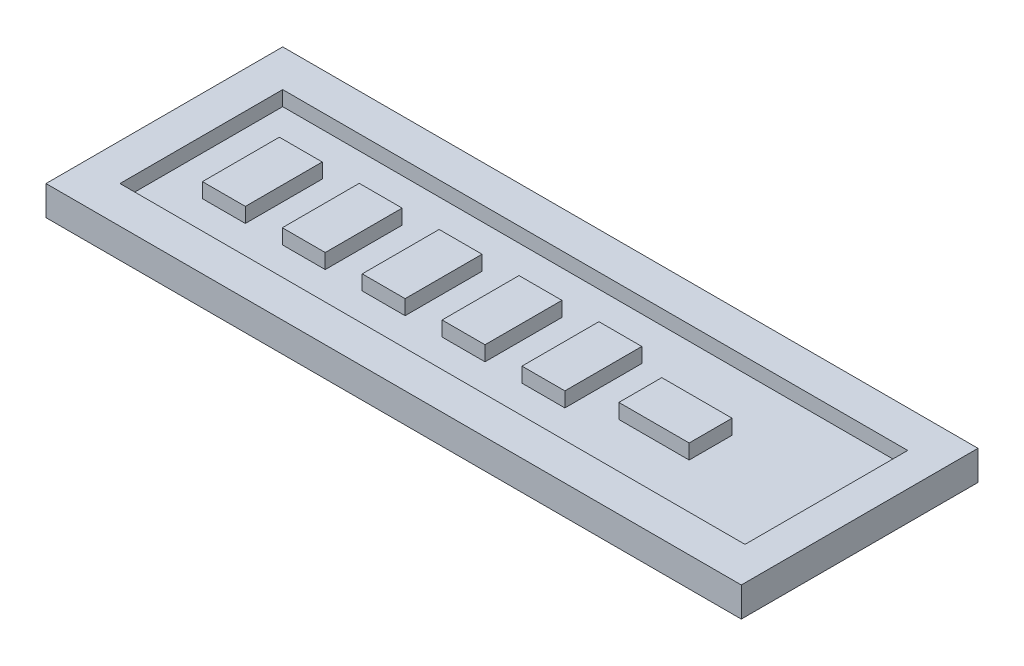
ISO-10303-21;
HEADER;
FILE_DESCRIPTION(('STEP AP214'),'2;1');
FILE_NAME('part.step','',(''),(''),'','','');
FILE_SCHEMA(('AUTOMOTIVE_DESIGN { 1 0 10303 214 1 1 1 1 }'));
ENDSEC;
DATA;
#1=APPLICATION_CONTEXT('core data for automotive mechanical design processes');
#2=APPLICATION_PROTOCOL_DEFINITION('international standard','automotive_design',2000,#1);
#3=PRODUCT_CONTEXT('',#1,'mechanical');
#4=PRODUCT('Part','Part','',(#3));
#5=PRODUCT_RELATED_PRODUCT_CATEGORY('part','',(#4));
#6=PRODUCT_DEFINITION_FORMATION('','',#4);
#7=PRODUCT_DEFINITION_CONTEXT('part definition',#1,'design');
#8=PRODUCT_DEFINITION('design','',#6,#7);
#9=PRODUCT_DEFINITION_SHAPE('','',#8);
#10=(LENGTH_UNIT() NAMED_UNIT(*) SI_UNIT(.MILLI.,.METRE.));
#11=(NAMED_UNIT(*) PLANE_ANGLE_UNIT() SI_UNIT($,.RADIAN.));
#12=(NAMED_UNIT(*) SI_UNIT($,.STERADIAN.) SOLID_ANGLE_UNIT());
#13=UNCERTAINTY_MEASURE_WITH_UNIT(LENGTH_MEASURE(1.E-05),#10,'distance_accuracy_value','');
#14=(GEOMETRIC_REPRESENTATION_CONTEXT(3) GLOBAL_UNCERTAINTY_ASSIGNED_CONTEXT((#13)) GLOBAL_UNIT_ASSIGNED_CONTEXT((#10,
#11,#12)) REPRESENTATION_CONTEXT('',''));
#15=CARTESIAN_POINT('',(0.,0.,0.));
#16=DIRECTION('',(0.,0.,1.));
#17=DIRECTION('',(1.,0.,0.));
#18=AXIS2_PLACEMENT_3D('',#15,#16,#17);
#19=CARTESIAN_POINT('',(0.,4.,0.));
#20=DIRECTION('',(0.,1.,0.));
#21=DIRECTION('',(0.,0.,1.));
#22=AXIS2_PLACEMENT_3D('',#19,#20,#21);
#23=PLANE('',#22);
#24=DIRECTION('',(1.,0.,0.));
#25=VECTOR('',#24,1.);
#26=CARTESIAN_POINT('',(0.,4.,0.));
#27=LINE('',#26,#25);
#28=CARTESIAN_POINT('',(0.,4.,0.));
#29=VERTEX_POINT('',#28);
#30=CARTESIAN_POINT('',(94.,4.,0.));
#31=VERTEX_POINT('',#30);
#32=EDGE_CURVE('E476',#29,#31,#27,.T.);
#33=ORIENTED_EDGE('',*,*,#32,.T.);
#34=DIRECTION('',(0.,0.,-1.));
#35=VECTOR('',#34,1.);
#36=CARTESIAN_POINT('',(94.,4.,0.));
#37=LINE('',#36,#35);
#38=CARTESIAN_POINT('',(94.,4.,-32.));
#39=VERTEX_POINT('',#38);
#40=EDGE_CURVE('E479',#31,#39,#37,.T.);
#41=ORIENTED_EDGE('',*,*,#40,.T.);
#42=DIRECTION('',(1.,0.,0.));
#43=VECTOR('',#42,1.);
#44=CARTESIAN_POINT('',(0.,4.,-32.));
#45=LINE('',#44,#43);
#46=CARTESIAN_POINT('',(0.,4.,-32.));
#47=VERTEX_POINT('',#46);
#48=EDGE_CURVE('E482',#47,#39,#45,.T.);
#49=ORIENTED_EDGE('',*,*,#48,.F.);
#50=DIRECTION('',(0.,0.,-1.));
#51=VECTOR('',#50,1.);
#52=CARTESIAN_POINT('',(0.,4.,0.));
#53=LINE('',#52,#51);
#54=EDGE_CURVE('E485',#29,#47,#53,.T.);
#55=ORIENTED_EDGE('',*,*,#54,.F.);
#56=EDGE_LOOP('',(#33,#41,#49,#55));
#57=FACE_BOUND('',#56,.T.);
#58=DIRECTION('',(-1.,0.,0.));
#59=VECTOR('',#58,1.);
#60=CARTESIAN_POINT('',(89.5,4.,-5.));
#61=LINE('',#60,#59);
#62=CARTESIAN_POINT('',(89.5,4.,-5.));
#63=VERTEX_POINT('',#62);
#64=CARTESIAN_POINT('',(4.99999999999995,4.,-5.));
#65=VERTEX_POINT('',#64);
#66=EDGE_CURVE('E347',#63,#65,#61,.T.);
#67=ORIENTED_EDGE('',*,*,#66,.T.);
#68=DIRECTION('',(0.,0.,-1.));
#69=VECTOR('',#68,1.);
#70=CARTESIAN_POINT('',(4.99999999999995,4.,-27.));
#71=LINE('',#70,#69);
#72=CARTESIAN_POINT('',(4.99999999999994,4.,-27.));
#73=VERTEX_POINT('',#72);
#74=EDGE_CURVE('E268',#65,#73,#71,.T.);
#75=ORIENTED_EDGE('',*,*,#74,.T.);
#76=DIRECTION('',(-1.,0.,0.));
#77=VECTOR('',#76,1.);
#78=CARTESIAN_POINT('',(89.5,4.,-27.));
#79=LINE('',#78,#77);
#80=CARTESIAN_POINT('',(89.5,4.,-27.));
#81=VERTEX_POINT('',#80);
#82=EDGE_CURVE('E266',#81,#73,#79,.T.);
#83=ORIENTED_EDGE('',*,*,#82,.F.);
#84=DIRECTION('',(0.,0.,1.));
#85=VECTOR('',#84,1.);
#86=CARTESIAN_POINT('',(89.5,4.,-27.));
#87=LINE('',#86,#85);
#88=EDGE_CURVE('E344',#81,#63,#87,.T.);
#89=ORIENTED_EDGE('',*,*,#88,.T.);
#90=EDGE_LOOP('',(#67,#75,#83,#89));
#91=FACE_BOUND('',#90,.T.);
#92=ADVANCED_FACE('F33',(#57,#91),#23,.T.);
#93=CARTESIAN_POINT('',(0.,4.,0.));
#94=DIRECTION('',(0.,0.,-1.));
#95=DIRECTION('',(-1.,0.,0.));
#96=AXIS2_PLACEMENT_3D('',#93,#94,#95);
#97=PLANE('',#96);
#98=DIRECTION('',(1.,0.,0.));
#99=VECTOR('',#98,1.);
#100=CARTESIAN_POINT('',(0.,0.,0.));
#101=LINE('',#100,#99);
#102=CARTESIAN_POINT('',(0.,0.,0.));
#103=VERTEX_POINT('',#102);
#104=CARTESIAN_POINT('',(94.,0.,0.));
#105=VERTEX_POINT('',#104);
#106=EDGE_CURVE('E424',#103,#105,#101,.T.);
#107=ORIENTED_EDGE('',*,*,#106,.T.);
#108=DIRECTION('',(0.,-1.,0.));
#109=VECTOR('',#108,1.);
#110=CARTESIAN_POINT('',(94.,4.,0.));
#111=LINE('',#110,#109);
#112=EDGE_CURVE('E11',#31,#105,#111,.T.);
#113=ORIENTED_EDGE('',*,*,#112,.F.);
#114=ORIENTED_EDGE('',*,*,#32,.F.);
#115=DIRECTION('',(0.,-1.,0.));
#116=VECTOR('',#115,1.);
#117=CARTESIAN_POINT('',(0.,4.,0.));
#118=LINE('',#117,#116);
#119=EDGE_CURVE('E488',#29,#103,#118,.T.);
#120=ORIENTED_EDGE('',*,*,#119,.T.);
#121=EDGE_LOOP('',(#107,#113,#114,#120));
#122=FACE_BOUND('',#121,.T.);
#123=ADVANCED_FACE('F35',(#122),#97,.F.);
#124=CARTESIAN_POINT('',(94.,4.,0.));
#125=DIRECTION('',(-1.,0.,0.));
#126=DIRECTION('',(0.,0.,1.));
#127=AXIS2_PLACEMENT_3D('',#124,#125,#126);
#128=PLANE('',#127);
#129=DIRECTION('',(0.,0.,-1.));
#130=VECTOR('',#129,1.);
#131=CARTESIAN_POINT('',(94.,0.,0.));
#132=LINE('',#131,#130);
#133=CARTESIAN_POINT('',(94.,0.,-32.));
#134=VERTEX_POINT('',#133);
#135=EDGE_CURVE('E491',#105,#134,#132,.T.);
#136=ORIENTED_EDGE('',*,*,#135,.T.);
#137=DIRECTION('',(0.,-1.,0.));
#138=VECTOR('',#137,1.);
#139=CARTESIAN_POINT('',(94.,4.,-32.));
#140=LINE('',#139,#138);
#141=EDGE_CURVE('E41',#39,#134,#140,.T.);
#142=ORIENTED_EDGE('',*,*,#141,.F.);
#143=ORIENTED_EDGE('',*,*,#40,.F.);
#144=ORIENTED_EDGE('',*,*,#112,.T.);
#145=EDGE_LOOP('',(#136,#142,#143,#144));
#146=FACE_BOUND('',#145,.T.);
#147=ADVANCED_FACE('F507',(#146),#128,.F.);
#148=CARTESIAN_POINT('',(0.,4.,-32.));
#149=DIRECTION('',(0.,0.,-1.));
#150=DIRECTION('',(-1.,0.,0.));
#151=AXIS2_PLACEMENT_3D('',#148,#149,#150);
#152=PLANE('',#151);
#153=DIRECTION('',(1.,0.,0.));
#154=VECTOR('',#153,1.);
#155=CARTESIAN_POINT('',(0.,0.,-32.));
#156=LINE('',#155,#154);
#157=CARTESIAN_POINT('',(0.,0.,-32.));
#158=VERTEX_POINT('',#157);
#159=EDGE_CURVE('E494',#158,#134,#156,.T.);
#160=ORIENTED_EDGE('',*,*,#159,.F.);
#161=DIRECTION('',(0.,-1.,0.));
#162=VECTOR('',#161,1.);
#163=CARTESIAN_POINT('',(0.,4.,-32.));
#164=LINE('',#163,#162);
#165=EDGE_CURVE('E500',#47,#158,#164,.T.);
#166=ORIENTED_EDGE('',*,*,#165,.F.);
#167=ORIENTED_EDGE('',*,*,#48,.T.);
#168=ORIENTED_EDGE('',*,*,#141,.T.);
#169=EDGE_LOOP('',(#160,#166,#167,#168));
#170=FACE_BOUND('',#169,.T.);
#171=ADVANCED_FACE('F504',(#170),#152,.T.);
#172=CARTESIAN_POINT('',(0.,4.,0.));
#173=DIRECTION('',(-1.,0.,0.));
#174=DIRECTION('',(0.,0.,1.));
#175=AXIS2_PLACEMENT_3D('',#172,#173,#174);
#176=PLANE('',#175);
#177=DIRECTION('',(0.,0.,-1.));
#178=VECTOR('',#177,1.);
#179=CARTESIAN_POINT('',(0.,0.,0.));
#180=LINE('',#179,#178);
#181=EDGE_CURVE('E480',#103,#158,#180,.T.);
#182=ORIENTED_EDGE('',*,*,#181,.F.);
#183=ORIENTED_EDGE('',*,*,#119,.F.);
#184=ORIENTED_EDGE('',*,*,#54,.T.);
#185=ORIENTED_EDGE('',*,*,#165,.T.);
#186=EDGE_LOOP('',(#182,#183,#184,#185));
#187=FACE_BOUND('',#186,.T.);
#188=ADVANCED_FACE('F514',(#187),#176,.T.);
#189=CARTESIAN_POINT('',(0.,0.,0.));
#190=DIRECTION('',(0.,1.,0.));
#191=DIRECTION('',(0.,0.,1.));
#192=AXIS2_PLACEMENT_3D('',#189,#190,#191);
#193=PLANE('',#192);
#194=ORIENTED_EDGE('',*,*,#106,.F.);
#195=ORIENTED_EDGE('',*,*,#181,.T.);
#196=ORIENTED_EDGE('',*,*,#159,.T.);
#197=ORIENTED_EDGE('',*,*,#135,.F.);
#198=EDGE_LOOP('',(#194,#195,#196,#197));
#199=FACE_BOUND('',#198,.T.);
#200=ADVANCED_FACE('F511',(#199),#193,.F.);
#201=CARTESIAN_POINT('',(4.99999999999995,2.,-27.));
#202=DIRECTION('',(1.,0.,0.));
#203=DIRECTION('',(0.,0.,1.));
#204=AXIS2_PLACEMENT_3D('',#201,#202,#203);
#205=PLANE('',#204);
#206=DIRECTION('',(0.,-1.,0.));
#207=VECTOR('',#206,1.);
#208=CARTESIAN_POINT('',(4.99999999999994,2.,-27.));
#209=LINE('',#208,#207);
#210=CARTESIAN_POINT('',(4.99999999999995,2.,-27.));
#211=VERTEX_POINT('',#210);
#212=EDGE_CURVE('E259',#73,#211,#209,.T.);
#213=ORIENTED_EDGE('',*,*,#212,.F.);
#214=ORIENTED_EDGE('',*,*,#74,.F.);
#215=DIRECTION('',(0.,1.,0.));
#216=VECTOR('',#215,1.);
#217=CARTESIAN_POINT('',(4.99999999999995,-2.50000000000002,-5.));
#218=LINE('',#217,#216);
#219=CARTESIAN_POINT('',(4.99999999999995,2.,-5.));
#220=VERTEX_POINT('',#219);
#221=EDGE_CURVE('E262',#220,#65,#218,.T.);
#222=ORIENTED_EDGE('',*,*,#221,.F.);
#223=DIRECTION('',(0.,0.,1.));
#224=VECTOR('',#223,1.);
#225=CARTESIAN_POINT('',(4.99999999999995,2.,-27.));
#226=LINE('',#225,#224);
#227=EDGE_CURVE('E249',#211,#220,#226,.T.);
#228=ORIENTED_EDGE('',*,*,#227,.F.);
#229=EDGE_LOOP('',(#213,#214,#222,#228));
#230=FACE_BOUND('',#229,.T.);
#231=ADVANCED_FACE('F258',(#230),#205,.T.);
#232=CARTESIAN_POINT('',(89.5,2.,-27.));
#233=DIRECTION('',(0.,-1.,0.));
#234=DIRECTION('',(1.,0.,0.));
#235=AXIS2_PLACEMENT_3D('',#232,#233,#234);
#236=PLANE('',#235);
#237=DIRECTION('',(-1.,0.,0.));
#238=VECTOR('',#237,1.);
#239=CARTESIAN_POINT('',(89.5,2.,-21.2000000000001));
#240=LINE('',#239,#238);
#241=CARTESIAN_POINT('',(16.15,2.,-21.2000000000001));
#242=VERTEX_POINT('',#241);
#243=CARTESIAN_POINT('',(10.3499999999999,2.,-21.2000000000001));
#244=VERTEX_POINT('',#243);
#245=EDGE_CURVE('E282',#242,#244,#240,.T.);
#246=ORIENTED_EDGE('',*,*,#245,.F.);
#247=DIRECTION('',(0.,0.,1.));
#248=VECTOR('',#247,1.);
#249=CARTESIAN_POINT('',(16.15,2.,-27.));
#250=LINE('',#249,#248);
#251=CARTESIAN_POINT('',(16.15,2.,-10.8000000000001));
#252=VERTEX_POINT('',#251);
#253=EDGE_CURVE('E279',#242,#252,#250,.T.);
#254=ORIENTED_EDGE('',*,*,#253,.T.);
#255=DIRECTION('',(-1.,0.,0.));
#256=VECTOR('',#255,1.);
#257=CARTESIAN_POINT('',(89.5,2.,-10.8000000000001));
#258=LINE('',#257,#256);
#259=CARTESIAN_POINT('',(10.3499999999999,2.,-10.8000000000001));
#260=VERTEX_POINT('',#259);
#261=EDGE_CURVE('E276',#252,#260,#258,.T.);
#262=ORIENTED_EDGE('',*,*,#261,.T.);
#263=DIRECTION('',(0.,0.,1.));
#264=VECTOR('',#263,1.);
#265=CARTESIAN_POINT('',(10.3499999999999,2.,-27.));
#266=LINE('',#265,#264);
#267=EDGE_CURVE('E285',#244,#260,#266,.T.);
#268=ORIENTED_EDGE('',*,*,#267,.F.);
#269=EDGE_LOOP('',(#246,#254,#262,#268));
#270=FACE_BOUND('',#269,.T.);
#271=ORIENTED_EDGE('',*,*,#227,.T.);
#272=DIRECTION('',(-1.,0.,0.));
#273=VECTOR('',#272,1.);
#274=CARTESIAN_POINT('',(89.5,2.,-5.));
#275=LINE('',#274,#273);
#276=CARTESIAN_POINT('',(89.5,2.,-5.));
#277=VERTEX_POINT('',#276);
#278=EDGE_CURVE('E274',#277,#220,#275,.T.);
#279=ORIENTED_EDGE('',*,*,#278,.F.);
#280=DIRECTION('',(0.,0.,1.));
#281=VECTOR('',#280,1.);
#282=CARTESIAN_POINT('',(89.5,2.,-27.));
#283=LINE('',#282,#281);
#284=CARTESIAN_POINT('',(89.5,2.,-27.));
#285=VERTEX_POINT('',#284);
#286=EDGE_CURVE('E252',#285,#277,#283,.T.);
#287=ORIENTED_EDGE('',*,*,#286,.F.);
#288=DIRECTION('',(-1.,0.,0.));
#289=VECTOR('',#288,1.);
#290=CARTESIAN_POINT('',(89.5,2.,-27.));
#291=LINE('',#290,#289);
#292=EDGE_CURVE('E245',#285,#211,#291,.T.);
#293=ORIENTED_EDGE('',*,*,#292,.T.);
#294=EDGE_LOOP('',(#271,#279,#287,#293));
#295=FACE_BOUND('',#294,.T.);
#296=DIRECTION('',(-1.,0.,0.));
#297=VECTOR('',#296,1.);
#298=CARTESIAN_POINT('',(89.5,2.,-13.1));
#299=LINE('',#298,#297);
#300=CARTESIAN_POINT('',(73.8499999999999,2.,-13.1));
#301=VERTEX_POINT('',#300);
#302=CARTESIAN_POINT('',(64.35,2.,-13.1));
#303=VERTEX_POINT('',#302);
#304=EDGE_CURVE('E331',#301,#303,#299,.T.);
#305=ORIENTED_EDGE('',*,*,#304,.T.);
#306=DIRECTION('',(0.,0.,1.));
#307=VECTOR('',#306,1.);
#308=CARTESIAN_POINT('',(64.35,2.,-27.));
#309=LINE('',#308,#307);
#310=CARTESIAN_POINT('',(64.35,2.,-18.9));
#311=VERTEX_POINT('',#310);
#312=EDGE_CURVE('E340',#311,#303,#309,.T.);
#313=ORIENTED_EDGE('',*,*,#312,.F.);
#314=DIRECTION('',(-1.,0.,0.));
#315=VECTOR('',#314,1.);
#316=CARTESIAN_POINT('',(89.5,2.,-18.9));
#317=LINE('',#316,#315);
#318=CARTESIAN_POINT('',(73.8499999999999,2.,-18.9));
#319=VERTEX_POINT('',#318);
#320=EDGE_CURVE('E337',#319,#311,#317,.T.);
#321=ORIENTED_EDGE('',*,*,#320,.F.);
#322=DIRECTION('',(0.,0.,1.));
#323=VECTOR('',#322,1.);
#324=CARTESIAN_POINT('',(73.8499999999999,2.,-27.));
#325=LINE('',#324,#323);
#326=EDGE_CURVE('E334',#319,#301,#325,.T.);
#327=ORIENTED_EDGE('',*,*,#326,.T.);
#328=EDGE_LOOP('',(#305,#313,#321,#327));
#329=FACE_BOUND('',#328,.T.);
#330=DIRECTION('',(-1.,0.,0.));
#331=VECTOR('',#330,1.);
#332=CARTESIAN_POINT('',(89.5,2.,-10.8));
#333=LINE('',#332,#331);
#334=CARTESIAN_POINT('',(59.3499999999999,2.,-10.8));
#335=VERTEX_POINT('',#334);
#336=CARTESIAN_POINT('',(53.55,2.,-10.8));
#337=VERTEX_POINT('',#336);
#338=EDGE_CURVE('E320',#335,#337,#333,.T.);
#339=ORIENTED_EDGE('',*,*,#338,.T.);
#340=DIRECTION('',(0.,0.,1.));
#341=VECTOR('',#340,1.);
#342=CARTESIAN_POINT('',(53.55,2.,-27.));
#343=LINE('',#342,#341);
#344=CARTESIAN_POINT('',(53.55,2.,-21.2));
#345=VERTEX_POINT('',#344);
#346=EDGE_CURVE('E329',#345,#337,#343,.T.);
#347=ORIENTED_EDGE('',*,*,#346,.F.);
#348=DIRECTION('',(-1.,0.,0.));
#349=VECTOR('',#348,1.);
#350=CARTESIAN_POINT('',(89.5,2.,-21.2));
#351=LINE('',#350,#349);
#352=CARTESIAN_POINT('',(59.3499999999999,2.,-21.2));
#353=VERTEX_POINT('',#352);
#354=EDGE_CURVE('E326',#353,#345,#351,.T.);
#355=ORIENTED_EDGE('',*,*,#354,.F.);
#356=DIRECTION('',(0.,0.,1.));
#357=VECTOR('',#356,1.);
#358=CARTESIAN_POINT('',(59.3499999999999,2.,-27.));
#359=LINE('',#358,#357);
#360=EDGE_CURVE('E323',#353,#335,#359,.T.);
#361=ORIENTED_EDGE('',*,*,#360,.T.);
#362=EDGE_LOOP('',(#339,#347,#355,#361));
#363=FACE_BOUND('',#362,.T.);
#364=DIRECTION('',(-1.,0.,0.));
#365=VECTOR('',#364,1.);
#366=CARTESIAN_POINT('',(89.5,2.,-10.8));
#367=LINE('',#366,#365);
#368=CARTESIAN_POINT('',(48.5499999999999,2.,-10.8));
#369=VERTEX_POINT('',#368);
#370=CARTESIAN_POINT('',(42.75,2.,-10.8));
#371=VERTEX_POINT('',#370);
#372=EDGE_CURVE('E309',#369,#371,#367,.T.);
#373=ORIENTED_EDGE('',*,*,#372,.T.);
#374=DIRECTION('',(0.,0.,1.));
#375=VECTOR('',#374,1.);
#376=CARTESIAN_POINT('',(42.75,2.,-27.));
#377=LINE('',#376,#375);
#378=CARTESIAN_POINT('',(42.75,2.,-21.2));
#379=VERTEX_POINT('',#378);
#380=EDGE_CURVE('E318',#379,#371,#377,.T.);
#381=ORIENTED_EDGE('',*,*,#380,.F.);
#382=DIRECTION('',(-1.,0.,0.));
#383=VECTOR('',#382,1.);
#384=CARTESIAN_POINT('',(89.5,2.,-21.2));
#385=LINE('',#384,#383);
#386=CARTESIAN_POINT('',(48.5499999999999,2.,-21.2));
#387=VERTEX_POINT('',#386);
#388=EDGE_CURVE('E315',#387,#379,#385,.T.);
#389=ORIENTED_EDGE('',*,*,#388,.F.);
#390=DIRECTION('',(0.,0.,1.));
#391=VECTOR('',#390,1.);
#392=CARTESIAN_POINT('',(48.5499999999999,2.,-27.));
#393=LINE('',#392,#391);
#394=EDGE_CURVE('E312',#387,#369,#393,.T.);
#395=ORIENTED_EDGE('',*,*,#394,.T.);
#396=EDGE_LOOP('',(#373,#381,#389,#395));
#397=FACE_BOUND('',#396,.T.);
#398=DIRECTION('',(-1.,0.,0.));
#399=VECTOR('',#398,1.);
#400=CARTESIAN_POINT('',(89.5,2.,-10.8000000000001));
#401=LINE('',#400,#399);
#402=CARTESIAN_POINT('',(37.7499999999999,2.,-10.8000000000001));
#403=VERTEX_POINT('',#402);
#404=CARTESIAN_POINT('',(31.9499999999999,2.,-10.8000000000001));
#405=VERTEX_POINT('',#404);
#406=EDGE_CURVE('E298',#403,#405,#401,.T.);
#407=ORIENTED_EDGE('',*,*,#406,.T.);
#408=DIRECTION('',(0.,0.,1.));
#409=VECTOR('',#408,1.);
#410=CARTESIAN_POINT('',(31.9499999999999,2.,-27.));
#411=LINE('',#410,#409);
#412=CARTESIAN_POINT('',(31.9499999999999,2.,-21.2000000000001));
#413=VERTEX_POINT('',#412);
#414=EDGE_CURVE('E307',#413,#405,#411,.T.);
#415=ORIENTED_EDGE('',*,*,#414,.F.);
#416=DIRECTION('',(-1.,0.,0.));
#417=VECTOR('',#416,1.);
#418=CARTESIAN_POINT('',(89.5,2.,-21.2000000000001));
#419=LINE('',#418,#417);
#420=CARTESIAN_POINT('',(37.7499999999999,2.,-21.2000000000001));
#421=VERTEX_POINT('',#420);
#422=EDGE_CURVE('E304',#421,#413,#419,.T.);
#423=ORIENTED_EDGE('',*,*,#422,.F.);
#424=DIRECTION('',(0.,0.,1.));
#425=VECTOR('',#424,1.);
#426=CARTESIAN_POINT('',(37.7499999999999,2.,-27.));
#427=LINE('',#426,#425);
#428=EDGE_CURVE('E301',#421,#403,#427,.T.);
#429=ORIENTED_EDGE('',*,*,#428,.T.);
#430=EDGE_LOOP('',(#407,#415,#423,#429));
#431=FACE_BOUND('',#430,.T.);
#432=DIRECTION('',(-1.,0.,0.));
#433=VECTOR('',#432,1.);
#434=CARTESIAN_POINT('',(89.5,2.,-10.8000000000001));
#435=LINE('',#434,#433);
#436=CARTESIAN_POINT('',(26.9499999999999,2.,-10.8000000000001));
#437=VERTEX_POINT('',#436);
#438=CARTESIAN_POINT('',(21.15,2.,-10.8000000000001));
#439=VERTEX_POINT('',#438);
#440=EDGE_CURVE('E287',#437,#439,#435,.T.);
#441=ORIENTED_EDGE('',*,*,#440,.T.);
#442=DIRECTION('',(0.,0.,1.));
#443=VECTOR('',#442,1.);
#444=CARTESIAN_POINT('',(21.15,2.,-27.));
#445=LINE('',#444,#443);
#446=CARTESIAN_POINT('',(21.15,2.,-21.2000000000001));
#447=VERTEX_POINT('',#446);
#448=EDGE_CURVE('E296',#447,#439,#445,.T.);
#449=ORIENTED_EDGE('',*,*,#448,.F.);
#450=DIRECTION('',(-1.,0.,0.));
#451=VECTOR('',#450,1.);
#452=CARTESIAN_POINT('',(89.5,2.,-21.2000000000001));
#453=LINE('',#452,#451);
#454=CARTESIAN_POINT('',(26.9499999999999,2.,-21.2000000000001));
#455=VERTEX_POINT('',#454);
#456=EDGE_CURVE('E293',#455,#447,#453,.T.);
#457=ORIENTED_EDGE('',*,*,#456,.F.);
#458=DIRECTION('',(0.,0.,1.));
#459=VECTOR('',#458,1.);
#460=CARTESIAN_POINT('',(26.9499999999999,2.,-27.));
#461=LINE('',#460,#459);
#462=EDGE_CURVE('E290',#455,#437,#461,.T.);
#463=ORIENTED_EDGE('',*,*,#462,.T.);
#464=EDGE_LOOP('',(#441,#449,#457,#463));
#465=FACE_BOUND('',#464,.T.);
#466=ADVANCED_FACE('F247',(#270,#295,#329,#363,#397,#431,#465),#236,.F.);
#467=CARTESIAN_POINT('',(89.5,2.,-13.1));
#468=DIRECTION('',(0.,0.,-1.));
#469=DIRECTION('',(1.,0.,0.));
#470=AXIS2_PLACEMENT_3D('',#467,#468,#469);
#471=PLANE('',#470);
#472=DIRECTION('',(-1.,0.,0.));
#473=VECTOR('',#472,1.);
#474=CARTESIAN_POINT('',(89.5,4.,-13.1));
#475=LINE('',#474,#473);
#476=CARTESIAN_POINT('',(73.8499999999999,4.,-13.1));
#477=VERTEX_POINT('',#476);
#478=CARTESIAN_POINT('',(64.35,4.,-13.1));
#479=VERTEX_POINT('',#478);
#480=EDGE_CURVE('E403',#477,#479,#475,.T.);
#481=ORIENTED_EDGE('',*,*,#480,.T.);
#482=DIRECTION('',(0.,1.,0.));
#483=VECTOR('',#482,1.);
#484=CARTESIAN_POINT('',(64.35,2.,-13.1));
#485=LINE('',#484,#483);
#486=EDGE_CURVE('E413',#303,#479,#485,.T.);
#487=ORIENTED_EDGE('',*,*,#486,.F.);
#488=ORIENTED_EDGE('',*,*,#304,.F.);
#489=DIRECTION('',(0.,1.,0.));
#490=VECTOR('',#489,1.);
#491=CARTESIAN_POINT('',(73.8499999999999,2.,-13.1));
#492=LINE('',#491,#490);
#493=EDGE_CURVE('E422',#301,#477,#492,.T.);
#494=ORIENTED_EDGE('',*,*,#493,.T.);
#495=EDGE_LOOP('',(#481,#487,#488,#494));
#496=FACE_BOUND('',#495,.T.);
#497=ADVANCED_FACE('F603',(#496),#471,.F.);
#498=CARTESIAN_POINT('',(73.8499999999999,2.,-27.));
#499=DIRECTION('',(-1.,0.,0.));
#500=DIRECTION('',(0.,0.,-1.));
#501=AXIS2_PLACEMENT_3D('',#498,#499,#500);
#502=PLANE('',#501);
#503=DIRECTION('',(0.,0.,1.));
#504=VECTOR('',#503,1.);
#505=CARTESIAN_POINT('',(73.8499999999999,4.,-27.));
#506=LINE('',#505,#504);
#507=CARTESIAN_POINT('',(73.8499999999999,4.,-18.9));
#508=VERTEX_POINT('',#507);
#509=EDGE_CURVE('E405',#508,#477,#506,.T.);
#510=ORIENTED_EDGE('',*,*,#509,.T.);
#511=ORIENTED_EDGE('',*,*,#493,.F.);
#512=ORIENTED_EDGE('',*,*,#326,.F.);
#513=DIRECTION('',(0.,1.,0.));
#514=VECTOR('',#513,1.);
#515=CARTESIAN_POINT('',(73.8499999999999,2.,-18.9));
#516=LINE('',#515,#514);
#517=EDGE_CURVE('E420',#319,#508,#516,.T.);
#518=ORIENTED_EDGE('',*,*,#517,.T.);
#519=EDGE_LOOP('',(#510,#511,#512,#518));
#520=FACE_BOUND('',#519,.T.);
#521=ADVANCED_FACE('F652',(#520),#502,.F.);
#522=CARTESIAN_POINT('',(89.5,2.,-18.9));
#523=DIRECTION('',(0.,0.,-1.));
#524=DIRECTION('',(1.,0.,0.));
#525=AXIS2_PLACEMENT_3D('',#522,#523,#524);
#526=PLANE('',#525);
#527=DIRECTION('',(-1.,0.,0.));
#528=VECTOR('',#527,1.);
#529=CARTESIAN_POINT('',(89.5,4.,-18.9));
#530=LINE('',#529,#528);
#531=CARTESIAN_POINT('',(64.35,4.,-18.9));
#532=VERTEX_POINT('',#531);
#533=EDGE_CURVE('E408',#508,#532,#530,.T.);
#534=ORIENTED_EDGE('',*,*,#533,.F.);
#535=ORIENTED_EDGE('',*,*,#517,.F.);
#536=ORIENTED_EDGE('',*,*,#320,.T.);
#537=DIRECTION('',(0.,1.,0.));
#538=VECTOR('',#537,1.);
#539=CARTESIAN_POINT('',(64.35,2.,-18.9));
#540=LINE('',#539,#538);
#541=EDGE_CURVE('E416',#311,#532,#540,.T.);
#542=ORIENTED_EDGE('',*,*,#541,.T.);
#543=EDGE_LOOP('',(#534,#535,#536,#542));
#544=FACE_BOUND('',#543,.T.);
#545=ADVANCED_FACE('F662',(#544),#526,.T.);
#546=CARTESIAN_POINT('',(89.5,2.,-10.8));
#547=DIRECTION('',(0.,0.,-1.));
#548=DIRECTION('',(1.,0.,0.));
#549=AXIS2_PLACEMENT_3D('',#546,#547,#548);
#550=PLANE('',#549);
#551=DIRECTION('',(-1.,0.,0.));
#552=VECTOR('',#551,1.);
#553=CARTESIAN_POINT('',(89.5,4.,-10.8));
#554=LINE('',#553,#552);
#555=CARTESIAN_POINT('',(59.3499999999999,4.,-10.8));
#556=VERTEX_POINT('',#555);
#557=CARTESIAN_POINT('',(53.55,4.,-10.8));
#558=VERTEX_POINT('',#557);
#559=EDGE_CURVE('E48',#556,#558,#554,.T.);
#560=ORIENTED_EDGE('',*,*,#559,.T.);
#561=DIRECTION('',(0.,1.,0.));
#562=VECTOR('',#561,1.);
#563=CARTESIAN_POINT('',(53.55,2.,-10.8));
#564=LINE('',#563,#562);
#565=EDGE_CURVE('E425',#337,#558,#564,.T.);
#566=ORIENTED_EDGE('',*,*,#565,.F.);
#567=ORIENTED_EDGE('',*,*,#338,.F.);
#568=DIRECTION('',(0.,1.,0.));
#569=VECTOR('',#568,1.);
#570=CARTESIAN_POINT('',(59.3499999999999,2.,-10.8));
#571=LINE('',#570,#569);
#572=EDGE_CURVE('E417',#335,#556,#571,.T.);
#573=ORIENTED_EDGE('',*,*,#572,.T.);
#574=EDGE_LOOP('',(#560,#566,#567,#573));
#575=FACE_BOUND('',#574,.T.);
#576=ADVANCED_FACE('F672',(#575),#550,.F.);
#577=CARTESIAN_POINT('',(59.3499999999999,2.,-27.));
#578=DIRECTION('',(-1.,0.,0.));
#579=DIRECTION('',(0.,0.,-1.));
#580=AXIS2_PLACEMENT_3D('',#577,#578,#579);
#581=PLANE('',#580);
#582=DIRECTION('',(0.,0.,1.));
#583=VECTOR('',#582,1.);
#584=CARTESIAN_POINT('',(59.3499999999999,4.,-27.));
#585=LINE('',#584,#583);
#586=CARTESIAN_POINT('',(59.3499999999999,4.,-21.2));
#587=VERTEX_POINT('',#586);
#588=EDGE_CURVE('E394',#587,#556,#585,.T.);
#589=ORIENTED_EDGE('',*,*,#588,.T.);
#590=ORIENTED_EDGE('',*,*,#572,.F.);
#591=ORIENTED_EDGE('',*,*,#360,.F.);
#592=DIRECTION('',(0.,1.,0.));
#593=VECTOR('',#592,1.);
#594=CARTESIAN_POINT('',(59.3499999999999,2.,-21.2));
#595=LINE('',#594,#593);
#596=EDGE_CURVE('E431',#353,#587,#595,.T.);
#597=ORIENTED_EDGE('',*,*,#596,.T.);
#598=EDGE_LOOP('',(#589,#590,#591,#597));
#599=FACE_BOUND('',#598,.T.);
#600=ADVANCED_FACE('F682',(#599),#581,.F.);
#601=CARTESIAN_POINT('',(89.5,2.,-21.2));
#602=DIRECTION('',(0.,0.,-1.));
#603=DIRECTION('',(1.,0.,0.));
#604=AXIS2_PLACEMENT_3D('',#601,#602,#603);
#605=PLANE('',#604);
#606=DIRECTION('',(-1.,0.,0.));
#607=VECTOR('',#606,1.);
#608=CARTESIAN_POINT('',(89.5,4.,-21.2));
#609=LINE('',#608,#607);
#610=CARTESIAN_POINT('',(53.55,4.,-21.2));
#611=VERTEX_POINT('',#610);
#612=EDGE_CURVE('E397',#587,#611,#609,.T.);
#613=ORIENTED_EDGE('',*,*,#612,.F.);
#614=ORIENTED_EDGE('',*,*,#596,.F.);
#615=ORIENTED_EDGE('',*,*,#354,.T.);
#616=DIRECTION('',(0.,1.,0.));
#617=VECTOR('',#616,1.);
#618=CARTESIAN_POINT('',(53.55,2.,-21.2));
#619=LINE('',#618,#617);
#620=EDGE_CURVE('E427',#345,#611,#619,.T.);
#621=ORIENTED_EDGE('',*,*,#620,.T.);
#622=EDGE_LOOP('',(#613,#614,#615,#621));
#623=FACE_BOUND('',#622,.T.);
#624=ADVANCED_FACE('F691',(#623),#605,.T.);
#625=CARTESIAN_POINT('',(89.5,2.,-10.8));
#626=DIRECTION('',(0.,0.,-1.));
#627=DIRECTION('',(1.,0.,0.));
#628=AXIS2_PLACEMENT_3D('',#625,#626,#627);
#629=PLANE('',#628);
#630=DIRECTION('',(-1.,0.,0.));
#631=VECTOR('',#630,1.);
#632=CARTESIAN_POINT('',(89.5,4.,-10.8));
#633=LINE('',#632,#631);
#634=CARTESIAN_POINT('',(48.5499999999999,4.,-10.8));
#635=VERTEX_POINT('',#634);
#636=CARTESIAN_POINT('',(42.75,4.,-10.8));
#637=VERTEX_POINT('',#636);
#638=EDGE_CURVE('E56',#635,#637,#633,.T.);
#639=ORIENTED_EDGE('',*,*,#638,.T.);
#640=DIRECTION('',(0.,1.,0.));
#641=VECTOR('',#640,1.);
#642=CARTESIAN_POINT('',(42.75,2.,-10.8));
#643=LINE('',#642,#641);
#644=EDGE_CURVE('E434',#371,#637,#643,.T.);
#645=ORIENTED_EDGE('',*,*,#644,.F.);
#646=ORIENTED_EDGE('',*,*,#372,.F.);
#647=DIRECTION('',(0.,1.,0.));
#648=VECTOR('',#647,1.);
#649=CARTESIAN_POINT('',(48.5499999999999,2.,-10.8));
#650=LINE('',#649,#648);
#651=EDGE_CURVE('E428',#369,#635,#650,.T.);
#652=ORIENTED_EDGE('',*,*,#651,.T.);
#653=EDGE_LOOP('',(#639,#645,#646,#652));
#654=FACE_BOUND('',#653,.T.);
#655=ADVANCED_FACE('F701',(#654),#629,.F.);
#656=CARTESIAN_POINT('',(48.5499999999999,2.,-27.));
#657=DIRECTION('',(-1.,0.,0.));
#658=DIRECTION('',(0.,0.,-1.));
#659=AXIS2_PLACEMENT_3D('',#656,#657,#658);
#660=PLANE('',#659);
#661=DIRECTION('',(0.,0.,1.));
#662=VECTOR('',#661,1.);
#663=CARTESIAN_POINT('',(48.5499999999999,4.,-27.));
#664=LINE('',#663,#662);
#665=CARTESIAN_POINT('',(48.5499999999999,4.,-21.2));
#666=VERTEX_POINT('',#665);
#667=EDGE_CURVE('E384',#666,#635,#664,.T.);
#668=ORIENTED_EDGE('',*,*,#667,.T.);
#669=ORIENTED_EDGE('',*,*,#651,.F.);
#670=ORIENTED_EDGE('',*,*,#394,.F.);
#671=DIRECTION('',(0.,1.,0.));
#672=VECTOR('',#671,1.);
#673=CARTESIAN_POINT('',(48.5499999999999,2.,-21.2));
#674=LINE('',#673,#672);
#675=EDGE_CURVE('E440',#387,#666,#674,.T.);
#676=ORIENTED_EDGE('',*,*,#675,.T.);
#677=EDGE_LOOP('',(#668,#669,#670,#676));
#678=FACE_BOUND('',#677,.T.);
#679=ADVANCED_FACE('F711',(#678),#660,.F.);
#680=CARTESIAN_POINT('',(89.5,2.,-21.2));
#681=DIRECTION('',(0.,0.,-1.));
#682=DIRECTION('',(1.,0.,0.));
#683=AXIS2_PLACEMENT_3D('',#680,#681,#682);
#684=PLANE('',#683);
#685=DIRECTION('',(-1.,0.,0.));
#686=VECTOR('',#685,1.);
#687=CARTESIAN_POINT('',(89.5,4.,-21.2));
#688=LINE('',#687,#686);
#689=CARTESIAN_POINT('',(42.75,4.,-21.2));
#690=VERTEX_POINT('',#689);
#691=EDGE_CURVE('E387',#666,#690,#688,.T.);
#692=ORIENTED_EDGE('',*,*,#691,.F.);
#693=ORIENTED_EDGE('',*,*,#675,.F.);
#694=ORIENTED_EDGE('',*,*,#388,.T.);
#695=DIRECTION('',(0.,1.,0.));
#696=VECTOR('',#695,1.);
#697=CARTESIAN_POINT('',(42.75,2.,-21.2));
#698=LINE('',#697,#696);
#699=EDGE_CURVE('E436',#379,#690,#698,.T.);
#700=ORIENTED_EDGE('',*,*,#699,.T.);
#701=EDGE_LOOP('',(#692,#693,#694,#700));
#702=FACE_BOUND('',#701,.T.);
#703=ADVANCED_FACE('F720',(#702),#684,.T.);
#704=CARTESIAN_POINT('',(89.5,2.,-10.8000000000001));
#705=DIRECTION('',(0.,0.,-1.));
#706=DIRECTION('',(1.,0.,0.));
#707=AXIS2_PLACEMENT_3D('',#704,#705,#706);
#708=PLANE('',#707);
#709=DIRECTION('',(-1.,0.,0.));
#710=VECTOR('',#709,1.);
#711=CARTESIAN_POINT('',(89.5,4.,-10.8000000000001));
#712=LINE('',#711,#710);
#713=CARTESIAN_POINT('',(37.7499999999999,4.,-10.8000000000001));
#714=VERTEX_POINT('',#713);
#715=CARTESIAN_POINT('',(31.9499999999999,4.,-10.8000000000001));
#716=VERTEX_POINT('',#715);
#717=EDGE_CURVE('E372',#714,#716,#712,.T.);
#718=ORIENTED_EDGE('',*,*,#717,.T.);
#719=DIRECTION('',(0.,1.,0.));
#720=VECTOR('',#719,1.);
#721=CARTESIAN_POINT('',(31.9499999999999,2.,-10.8000000000001));
#722=LINE('',#721,#720);
#723=EDGE_CURVE('E443',#405,#716,#722,.T.);
#724=ORIENTED_EDGE('',*,*,#723,.F.);
#725=ORIENTED_EDGE('',*,*,#406,.F.);
#726=DIRECTION('',(0.,1.,0.));
#727=VECTOR('',#726,1.);
#728=CARTESIAN_POINT('',(37.7499999999999,2.,-10.8000000000001));
#729=LINE('',#728,#727);
#730=EDGE_CURVE('E437',#403,#714,#729,.T.);
#731=ORIENTED_EDGE('',*,*,#730,.T.);
#732=EDGE_LOOP('',(#718,#724,#725,#731));
#733=FACE_BOUND('',#732,.T.);
#734=ADVANCED_FACE('F730',(#733),#708,.F.);
#735=CARTESIAN_POINT('',(37.7499999999999,2.,-27.));
#736=DIRECTION('',(-1.,0.,0.));
#737=DIRECTION('',(0.,0.,-1.));
#738=AXIS2_PLACEMENT_3D('',#735,#736,#737);
#739=PLANE('',#738);
#740=DIRECTION('',(0.,0.,1.));
#741=VECTOR('',#740,1.);
#742=CARTESIAN_POINT('',(37.7499999999999,4.,-27.));
#743=LINE('',#742,#741);
#744=CARTESIAN_POINT('',(37.7499999999999,4.,-21.2000000000001));
#745=VERTEX_POINT('',#744);
#746=EDGE_CURVE('E374',#745,#714,#743,.T.);
#747=ORIENTED_EDGE('',*,*,#746,.T.);
#748=ORIENTED_EDGE('',*,*,#730,.F.);
#749=ORIENTED_EDGE('',*,*,#428,.F.);
#750=DIRECTION('',(0.,1.,0.));
#751=VECTOR('',#750,1.);
#752=CARTESIAN_POINT('',(37.7499999999999,2.,-21.2000000000001));
#753=LINE('',#752,#751);
#754=EDGE_CURVE('E450',#421,#745,#753,.T.);
#755=ORIENTED_EDGE('',*,*,#754,.T.);
#756=EDGE_LOOP('',(#747,#748,#749,#755));
#757=FACE_BOUND('',#756,.T.);
#758=ADVANCED_FACE('F740',(#757),#739,.F.);
#759=CARTESIAN_POINT('',(89.5,2.,-21.2000000000001));
#760=DIRECTION('',(0.,0.,-1.));
#761=DIRECTION('',(1.,0.,0.));
#762=AXIS2_PLACEMENT_3D('',#759,#760,#761);
#763=PLANE('',#762);
#764=DIRECTION('',(-1.,0.,0.));
#765=VECTOR('',#764,1.);
#766=CARTESIAN_POINT('',(89.5,4.,-21.2000000000001));
#767=LINE('',#766,#765);
#768=CARTESIAN_POINT('',(31.9499999999999,4.,-21.2000000000001));
#769=VERTEX_POINT('',#768);
#770=EDGE_CURVE('E377',#745,#769,#767,.T.);
#771=ORIENTED_EDGE('',*,*,#770,.F.);
#772=ORIENTED_EDGE('',*,*,#754,.F.);
#773=ORIENTED_EDGE('',*,*,#422,.T.);
#774=DIRECTION('',(0.,1.,0.));
#775=VECTOR('',#774,1.);
#776=CARTESIAN_POINT('',(31.9499999999999,2.,-21.2000000000001));
#777=LINE('',#776,#775);
#778=EDGE_CURVE('E446',#413,#769,#777,.T.);
#779=ORIENTED_EDGE('',*,*,#778,.T.);
#780=EDGE_LOOP('',(#771,#772,#773,#779));
#781=FACE_BOUND('',#780,.T.);
#782=ADVANCED_FACE('F569',(#781),#763,.T.);
#783=CARTESIAN_POINT('',(89.5,2.,-10.8000000000001));
#784=DIRECTION('',(0.,0.,-1.));
#785=DIRECTION('',(1.,0.,0.));
#786=AXIS2_PLACEMENT_3D('',#783,#784,#785);
#787=PLANE('',#786);
#788=DIRECTION('',(-1.,0.,0.));
#789=VECTOR('',#788,1.);
#790=CARTESIAN_POINT('',(89.5,4.,-10.8000000000001));
#791=LINE('',#790,#789);
#792=CARTESIAN_POINT('',(26.9499999999999,4.,-10.8000000000001));
#793=VERTEX_POINT('',#792);
#794=CARTESIAN_POINT('',(21.15,4.,-10.8000000000001));
#795=VERTEX_POINT('',#794);
#796=EDGE_CURVE('E361',#793,#795,#791,.T.);
#797=ORIENTED_EDGE('',*,*,#796,.T.);
#798=DIRECTION('',(0.,1.,0.));
#799=VECTOR('',#798,1.);
#800=CARTESIAN_POINT('',(21.15,2.,-10.8000000000001));
#801=LINE('',#800,#799);
#802=EDGE_CURVE('E453',#439,#795,#801,.T.);
#803=ORIENTED_EDGE('',*,*,#802,.F.);
#804=ORIENTED_EDGE('',*,*,#440,.F.);
#805=DIRECTION('',(0.,1.,0.));
#806=VECTOR('',#805,1.);
#807=CARTESIAN_POINT('',(26.9499999999999,2.,-10.8000000000001));
#808=LINE('',#807,#806);
#809=EDGE_CURVE('E447',#437,#793,#808,.T.);
#810=ORIENTED_EDGE('',*,*,#809,.T.);
#811=EDGE_LOOP('',(#797,#803,#804,#810));
#812=FACE_BOUND('',#811,.T.);
#813=ADVANCED_FACE('F548',(#812),#787,.F.);
#814=CARTESIAN_POINT('',(26.9499999999999,2.,-27.));
#815=DIRECTION('',(-1.,0.,0.));
#816=DIRECTION('',(0.,0.,-1.));
#817=AXIS2_PLACEMENT_3D('',#814,#815,#816);
#818=PLANE('',#817);
#819=DIRECTION('',(0.,0.,1.));
#820=VECTOR('',#819,1.);
#821=CARTESIAN_POINT('',(26.9499999999999,4.,-27.));
#822=LINE('',#821,#820);
#823=CARTESIAN_POINT('',(26.9499999999999,4.,-21.2000000000001));
#824=VERTEX_POINT('',#823);
#825=EDGE_CURVE('E363',#824,#793,#822,.T.);
#826=ORIENTED_EDGE('',*,*,#825,.T.);
#827=ORIENTED_EDGE('',*,*,#809,.F.);
#828=ORIENTED_EDGE('',*,*,#462,.F.);
#829=DIRECTION('',(0.,1.,0.));
#830=VECTOR('',#829,1.);
#831=CARTESIAN_POINT('',(26.9499999999999,2.,-21.2000000000001));
#832=LINE('',#831,#830);
#833=EDGE_CURVE('E460',#455,#824,#832,.T.);
#834=ORIENTED_EDGE('',*,*,#833,.T.);
#835=EDGE_LOOP('',(#826,#827,#828,#834));
#836=FACE_BOUND('',#835,.T.);
#837=ADVANCED_FACE('F560',(#836),#818,.F.);
#838=CARTESIAN_POINT('',(89.5,2.,-21.2000000000001));
#839=DIRECTION('',(0.,0.,-1.));
#840=DIRECTION('',(1.,0.,0.));
#841=AXIS2_PLACEMENT_3D('',#838,#839,#840);
#842=PLANE('',#841);
#843=DIRECTION('',(-1.,0.,0.));
#844=VECTOR('',#843,1.);
#845=CARTESIAN_POINT('',(89.5,4.,-21.2000000000001));
#846=LINE('',#845,#844);
#847=CARTESIAN_POINT('',(21.15,4.,-21.2000000000001));
#848=VERTEX_POINT('',#847);
#849=EDGE_CURVE('E366',#824,#848,#846,.T.);
#850=ORIENTED_EDGE('',*,*,#849,.F.);
#851=ORIENTED_EDGE('',*,*,#833,.F.);
#852=ORIENTED_EDGE('',*,*,#456,.T.);
#853=DIRECTION('',(0.,1.,0.));
#854=VECTOR('',#853,1.);
#855=CARTESIAN_POINT('',(21.15,2.,-21.2000000000001));
#856=LINE('',#855,#854);
#857=EDGE_CURVE('E456',#447,#848,#856,.T.);
#858=ORIENTED_EDGE('',*,*,#857,.T.);
#859=EDGE_LOOP('',(#850,#851,#852,#858));
#860=FACE_BOUND('',#859,.T.);
#861=ADVANCED_FACE('F558',(#860),#842,.T.);
#862=CARTESIAN_POINT('',(89.5,2.,-10.8000000000001));
#863=DIRECTION('',(0.,0.,-1.));
#864=DIRECTION('',(1.,0.,0.));
#865=AXIS2_PLACEMENT_3D('',#862,#863,#864);
#866=PLANE('',#865);
#867=DIRECTION('',(-1.,0.,0.));
#868=VECTOR('',#867,1.);
#869=CARTESIAN_POINT('',(89.5,4.,-10.8000000000001));
#870=LINE('',#869,#868);
#871=CARTESIAN_POINT('',(16.15,4.,-10.8000000000001));
#872=VERTEX_POINT('',#871);
#873=CARTESIAN_POINT('',(10.3499999999999,4.,-10.8000000000001));
#874=VERTEX_POINT('',#873);
#875=EDGE_CURVE('E350',#872,#874,#870,.T.);
#876=ORIENTED_EDGE('',*,*,#875,.T.);
#877=DIRECTION('',(0.,1.,0.));
#878=VECTOR('',#877,1.);
#879=CARTESIAN_POINT('',(10.3499999999999,2.,-10.8000000000001));
#880=LINE('',#879,#878);
#881=EDGE_CURVE('E463',#260,#874,#880,.T.);
#882=ORIENTED_EDGE('',*,*,#881,.F.);
#883=ORIENTED_EDGE('',*,*,#261,.F.);
#884=DIRECTION('',(0.,1.,0.));
#885=VECTOR('',#884,1.);
#886=CARTESIAN_POINT('',(16.15,2.,-10.8000000000001));
#887=LINE('',#886,#885);
#888=EDGE_CURVE('E457',#252,#872,#887,.T.);
#889=ORIENTED_EDGE('',*,*,#888,.T.);
#890=EDGE_LOOP('',(#876,#882,#883,#889));
#891=FACE_BOUND('',#890,.T.);
#892=ADVANCED_FACE('F567',(#891),#866,.F.);
#893=CARTESIAN_POINT('',(16.15,2.,-27.));
#894=DIRECTION('',(-1.,0.,0.));
#895=DIRECTION('',(0.,0.,-1.));
#896=AXIS2_PLACEMENT_3D('',#893,#894,#895);
#897=PLANE('',#896);
#898=DIRECTION('',(0.,0.,1.));
#899=VECTOR('',#898,1.);
#900=CARTESIAN_POINT('',(16.15,4.,-27.));
#901=LINE('',#900,#899);
#902=CARTESIAN_POINT('',(16.15,4.,-21.2000000000001));
#903=VERTEX_POINT('',#902);
#904=EDGE_CURVE('E352',#903,#872,#901,.T.);
#905=ORIENTED_EDGE('',*,*,#904,.T.);
#906=ORIENTED_EDGE('',*,*,#888,.F.);
#907=ORIENTED_EDGE('',*,*,#253,.F.);
#908=DIRECTION('',(0.,1.,0.));
#909=VECTOR('',#908,1.);
#910=CARTESIAN_POINT('',(16.15,2.,-21.2000000000001));
#911=LINE('',#910,#909);
#912=EDGE_CURVE('E470',#242,#903,#911,.T.);
#913=ORIENTED_EDGE('',*,*,#912,.T.);
#914=EDGE_LOOP('',(#905,#906,#907,#913));
#915=FACE_BOUND('',#914,.T.);
#916=ADVANCED_FACE('F581',(#915),#897,.F.);
#917=CARTESIAN_POINT('',(89.5,2.,-21.2000000000001));
#918=DIRECTION('',(0.,0.,-1.));
#919=DIRECTION('',(1.,0.,0.));
#920=AXIS2_PLACEMENT_3D('',#917,#918,#919);
#921=PLANE('',#920);
#922=DIRECTION('',(-1.,0.,0.));
#923=VECTOR('',#922,1.);
#924=CARTESIAN_POINT('',(89.5,4.,-21.2000000000001));
#925=LINE('',#924,#923);
#926=CARTESIAN_POINT('',(10.3499999999999,4.,-21.2000000000001));
#927=VERTEX_POINT('',#926);
#928=EDGE_CURVE('E355',#903,#927,#925,.T.);
#929=ORIENTED_EDGE('',*,*,#928,.F.);
#930=ORIENTED_EDGE('',*,*,#912,.F.);
#931=ORIENTED_EDGE('',*,*,#245,.T.);
#932=DIRECTION('',(0.,1.,0.));
#933=VECTOR('',#932,1.);
#934=CARTESIAN_POINT('',(10.3499999999999,2.,-21.2000000000001));
#935=LINE('',#934,#933);
#936=EDGE_CURVE('E466',#244,#927,#935,.T.);
#937=ORIENTED_EDGE('',*,*,#936,.T.);
#938=EDGE_LOOP('',(#929,#930,#931,#937));
#939=FACE_BOUND('',#938,.T.);
#940=ADVANCED_FACE('F578',(#939),#921,.T.);
#941=CARTESIAN_POINT('',(89.5,2.,-27.));
#942=DIRECTION('',(0.,0.,-1.));
#943=DIRECTION('',(1.,0.,0.));
#944=AXIS2_PLACEMENT_3D('',#941,#942,#943);
#945=PLANE('',#944);
#946=ORIENTED_EDGE('',*,*,#292,.F.);
#947=DIRECTION('',(0.,1.,0.));
#948=VECTOR('',#947,1.);
#949=CARTESIAN_POINT('',(89.5,2.,-27.));
#950=LINE('',#949,#948);
#951=EDGE_CURVE('E467',#285,#81,#950,.T.);
#952=ORIENTED_EDGE('',*,*,#951,.T.);
#953=ORIENTED_EDGE('',*,*,#82,.T.);
#954=ORIENTED_EDGE('',*,*,#212,.T.);
#955=EDGE_LOOP('',(#946,#952,#953,#954));
#956=FACE_BOUND('',#955,.T.);
#957=ADVANCED_FACE('F264',(#956),#945,.F.);
#958=CARTESIAN_POINT('',(89.5,2.,-27.));
#959=DIRECTION('',(-1.,0.,0.));
#960=DIRECTION('',(0.,0.,-1.));
#961=AXIS2_PLACEMENT_3D('',#958,#959,#960);
#962=PLANE('',#961);
#963=ORIENTED_EDGE('',*,*,#88,.F.);
#964=ORIENTED_EDGE('',*,*,#951,.F.);
#965=ORIENTED_EDGE('',*,*,#286,.T.);
#966=DIRECTION('',(0.,1.,0.));
#967=VECTOR('',#966,1.);
#968=CARTESIAN_POINT('',(89.5,2.,-5.));
#969=LINE('',#968,#967);
#970=EDGE_CURVE('E341',#277,#63,#969,.T.);
#971=ORIENTED_EDGE('',*,*,#970,.T.);
#972=EDGE_LOOP('',(#963,#964,#965,#971));
#973=FACE_BOUND('',#972,.T.);
#974=ADVANCED_FACE('F592',(#973),#962,.T.);
#975=CARTESIAN_POINT('',(53.55,2.,-27.));
#976=DIRECTION('',(-1.,0.,0.));
#977=DIRECTION('',(0.,0.,-1.));
#978=AXIS2_PLACEMENT_3D('',#975,#976,#977);
#979=PLANE('',#978);
#980=DIRECTION('',(0.,0.,1.));
#981=VECTOR('',#980,1.);
#982=CARTESIAN_POINT('',(53.55,4.,-27.));
#983=LINE('',#982,#981);
#984=EDGE_CURVE('E400',#611,#558,#983,.T.);
#985=ORIENTED_EDGE('',*,*,#984,.F.);
#986=ORIENTED_EDGE('',*,*,#620,.F.);
#987=ORIENTED_EDGE('',*,*,#346,.T.);
#988=ORIENTED_EDGE('',*,*,#565,.T.);
#989=EDGE_LOOP('',(#985,#986,#987,#988));
#990=FACE_BOUND('',#989,.T.);
#991=ADVANCED_FACE('F595',(#990),#979,.T.);
#992=CARTESIAN_POINT('',(42.75,2.,-27.));
#993=DIRECTION('',(-1.,0.,0.));
#994=DIRECTION('',(0.,0.,-1.));
#995=AXIS2_PLACEMENT_3D('',#992,#993,#994);
#996=PLANE('',#995);
#997=DIRECTION('',(0.,0.,1.));
#998=VECTOR('',#997,1.);
#999=CARTESIAN_POINT('',(42.75,4.,-27.));
#1000=LINE('',#999,#998);
#1001=EDGE_CURVE('E390',#690,#637,#1000,.T.);
#1002=ORIENTED_EDGE('',*,*,#1001,.F.);
#1003=ORIENTED_EDGE('',*,*,#699,.F.);
#1004=ORIENTED_EDGE('',*,*,#380,.T.);
#1005=ORIENTED_EDGE('',*,*,#644,.T.);
#1006=EDGE_LOOP('',(#1002,#1003,#1004,#1005));
#1007=FACE_BOUND('',#1006,.T.);
#1008=ADVANCED_FACE('F816',(#1007),#996,.T.);
#1009=CARTESIAN_POINT('',(31.9499999999999,2.,-27.));
#1010=DIRECTION('',(-1.,0.,0.));
#1011=DIRECTION('',(0.,0.,-1.));
#1012=AXIS2_PLACEMENT_3D('',#1009,#1010,#1011);
#1013=PLANE('',#1012);
#1014=DIRECTION('',(0.,0.,1.));
#1015=VECTOR('',#1014,1.);
#1016=CARTESIAN_POINT('',(31.9499999999999,4.,-27.));
#1017=LINE('',#1016,#1015);
#1018=EDGE_CURVE('E380',#769,#716,#1017,.T.);
#1019=ORIENTED_EDGE('',*,*,#1018,.F.);
#1020=ORIENTED_EDGE('',*,*,#778,.F.);
#1021=ORIENTED_EDGE('',*,*,#414,.T.);
#1022=ORIENTED_EDGE('',*,*,#723,.T.);
#1023=EDGE_LOOP('',(#1019,#1020,#1021,#1022));
#1024=FACE_BOUND('',#1023,.T.);
#1025=ADVANCED_FACE('F826',(#1024),#1013,.T.);
#1026=CARTESIAN_POINT('',(21.15,2.,-27.));
#1027=DIRECTION('',(-1.,0.,0.));
#1028=DIRECTION('',(0.,0.,-1.));
#1029=AXIS2_PLACEMENT_3D('',#1026,#1027,#1028);
#1030=PLANE('',#1029);
#1031=DIRECTION('',(0.,0.,1.));
#1032=VECTOR('',#1031,1.);
#1033=CARTESIAN_POINT('',(21.15,4.,-27.));
#1034=LINE('',#1033,#1032);
#1035=EDGE_CURVE('E369',#848,#795,#1034,.T.);
#1036=ORIENTED_EDGE('',*,*,#1035,.F.);
#1037=ORIENTED_EDGE('',*,*,#857,.F.);
#1038=ORIENTED_EDGE('',*,*,#448,.T.);
#1039=ORIENTED_EDGE('',*,*,#802,.T.);
#1040=EDGE_LOOP('',(#1036,#1037,#1038,#1039));
#1041=FACE_BOUND('',#1040,.T.);
#1042=ADVANCED_FACE('F551',(#1041),#1030,.T.);
#1043=CARTESIAN_POINT('',(10.3499999999999,2.,-27.));
#1044=DIRECTION('',(-1.,0.,0.));
#1045=DIRECTION('',(0.,0.,-1.));
#1046=AXIS2_PLACEMENT_3D('',#1043,#1044,#1045);
#1047=PLANE('',#1046);
#1048=DIRECTION('',(0.,0.,1.));
#1049=VECTOR('',#1048,1.);
#1050=CARTESIAN_POINT('',(10.3499999999999,4.,-27.));
#1051=LINE('',#1050,#1049);
#1052=EDGE_CURVE('E358',#927,#874,#1051,.T.);
#1053=ORIENTED_EDGE('',*,*,#1052,.F.);
#1054=ORIENTED_EDGE('',*,*,#936,.F.);
#1055=ORIENTED_EDGE('',*,*,#267,.T.);
#1056=ORIENTED_EDGE('',*,*,#881,.T.);
#1057=EDGE_LOOP('',(#1053,#1054,#1055,#1056));
#1058=FACE_BOUND('',#1057,.T.);
#1059=ADVANCED_FACE('F573',(#1058),#1047,.T.);
#1060=CARTESIAN_POINT('',(89.5,2.,-5.));
#1061=DIRECTION('',(0.,0.,-1.));
#1062=DIRECTION('',(1.,0.,0.));
#1063=AXIS2_PLACEMENT_3D('',#1060,#1061,#1062);
#1064=PLANE('',#1063);
#1065=ORIENTED_EDGE('',*,*,#221,.T.);
#1066=ORIENTED_EDGE('',*,*,#66,.F.);
#1067=ORIENTED_EDGE('',*,*,#970,.F.);
#1068=ORIENTED_EDGE('',*,*,#278,.T.);
#1069=EDGE_LOOP('',(#1065,#1066,#1067,#1068));
#1070=FACE_BOUND('',#1069,.T.);
#1071=ADVANCED_FACE('F576',(#1070),#1064,.T.);
#1072=CARTESIAN_POINT('',(64.35,2.,-27.));
#1073=DIRECTION('',(-1.,0.,0.));
#1074=DIRECTION('',(0.,0.,-1.));
#1075=AXIS2_PLACEMENT_3D('',#1072,#1073,#1074);
#1076=PLANE('',#1075);
#1077=DIRECTION('',(0.,0.,1.));
#1078=VECTOR('',#1077,1.);
#1079=CARTESIAN_POINT('',(64.35,4.,-27.));
#1080=LINE('',#1079,#1078);
#1081=EDGE_CURVE('E255',#532,#479,#1080,.T.);
#1082=ORIENTED_EDGE('',*,*,#1081,.F.);
#1083=ORIENTED_EDGE('',*,*,#541,.F.);
#1084=ORIENTED_EDGE('',*,*,#312,.T.);
#1085=ORIENTED_EDGE('',*,*,#486,.T.);
#1086=EDGE_LOOP('',(#1082,#1083,#1084,#1085));
#1087=FACE_BOUND('',#1086,.T.);
#1088=ADVANCED_FACE('F534',(#1087),#1076,.T.);
#1089=ORIENTED_EDGE('',*,*,#875,.F.);
#1090=ORIENTED_EDGE('',*,*,#904,.F.);
#1091=ORIENTED_EDGE('',*,*,#928,.T.);
#1092=ORIENTED_EDGE('',*,*,#1052,.T.);
#1093=EDGE_LOOP('',(#1089,#1090,#1091,#1092));
#1094=FACE_BOUND('',#1093,.T.);
#1095=ADVANCED_FACE('F526',(#1094),#23,.T.);
#1096=ORIENTED_EDGE('',*,*,#796,.F.);
#1097=ORIENTED_EDGE('',*,*,#825,.F.);
#1098=ORIENTED_EDGE('',*,*,#849,.T.);
#1099=ORIENTED_EDGE('',*,*,#1035,.T.);
#1100=EDGE_LOOP('',(#1096,#1097,#1098,#1099));
#1101=FACE_BOUND('',#1100,.T.);
#1102=ADVANCED_FACE('F527',(#1101),#23,.T.);
#1103=ORIENTED_EDGE('',*,*,#717,.F.);
#1104=ORIENTED_EDGE('',*,*,#746,.F.);
#1105=ORIENTED_EDGE('',*,*,#770,.T.);
#1106=ORIENTED_EDGE('',*,*,#1018,.T.);
#1107=EDGE_LOOP('',(#1103,#1104,#1105,#1106));
#1108=FACE_BOUND('',#1107,.T.);
#1109=ADVANCED_FACE('F537',(#1108),#23,.T.);
#1110=ORIENTED_EDGE('',*,*,#638,.F.);
#1111=ORIENTED_EDGE('',*,*,#667,.F.);
#1112=ORIENTED_EDGE('',*,*,#691,.T.);
#1113=ORIENTED_EDGE('',*,*,#1001,.T.);
#1114=EDGE_LOOP('',(#1110,#1111,#1112,#1113));
#1115=FACE_BOUND('',#1114,.T.);
#1116=ADVANCED_FACE('F542',(#1115),#23,.T.);
#1117=ORIENTED_EDGE('',*,*,#559,.F.);
#1118=ORIENTED_EDGE('',*,*,#588,.F.);
#1119=ORIENTED_EDGE('',*,*,#612,.T.);
#1120=ORIENTED_EDGE('',*,*,#984,.T.);
#1121=EDGE_LOOP('',(#1117,#1118,#1119,#1120));
#1122=FACE_BOUND('',#1121,.T.);
#1123=ADVANCED_FACE('F889',(#1122),#23,.T.);
#1124=ORIENTED_EDGE('',*,*,#480,.F.);
#1125=ORIENTED_EDGE('',*,*,#509,.F.);
#1126=ORIENTED_EDGE('',*,*,#533,.T.);
#1127=ORIENTED_EDGE('',*,*,#1081,.T.);
#1128=EDGE_LOOP('',(#1124,#1125,#1126,#1127));
#1129=FACE_BOUND('',#1128,.T.);
#1130=ADVANCED_FACE('F530',(#1129),#23,.T.);
#1131=CLOSED_SHELL('',(#92,#123,#147,#171,#188,#200,#231,#466,#497,#521,#545,#576,#600,#624,
#655,#679,#703,#734,#758,#782,#813,#837,#861,#892,#916,#940,#957,#974,#991,#1008,#1025,#1042,
#1059,#1071,#1088,#1095,#1102,#1109,#1116,#1123,#1130));
#1132=MANIFOLD_SOLID_BREP('B2',#1131);
#1133=ADVANCED_BREP_SHAPE_REPRESENTATION('',(#18,#1132),#14);
#1134=SHAPE_DEFINITION_REPRESENTATION(#9,#1133);
ENDSEC;
END-ISO-10303-21;
